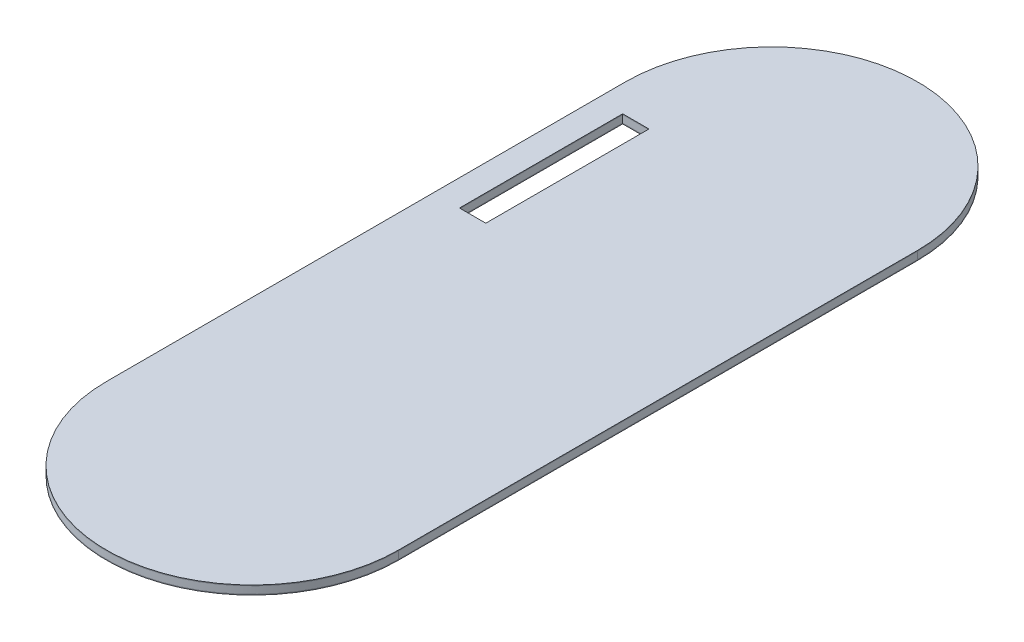
ISO-10303-21;
HEADER;
FILE_DESCRIPTION(('STEP AP214'),'2;1');
FILE_NAME('part.step','',(''),(''),'','','');
FILE_SCHEMA(('AUTOMOTIVE_DESIGN { 1 0 10303 214 1 1 1 1 }'));
ENDSEC;
DATA;
#1=APPLICATION_CONTEXT('core data for automotive mechanical design processes');
#2=APPLICATION_PROTOCOL_DEFINITION('international standard','automotive_design',2000,#1);
#3=PRODUCT_CONTEXT('',#1,'mechanical');
#4=PRODUCT('Part','Part','',(#3));
#5=PRODUCT_RELATED_PRODUCT_CATEGORY('part','',(#4));
#6=PRODUCT_DEFINITION_FORMATION('','',#4);
#7=PRODUCT_DEFINITION_CONTEXT('part definition',#1,'design');
#8=PRODUCT_DEFINITION('design','',#6,#7);
#9=PRODUCT_DEFINITION_SHAPE('','',#8);
#10=(LENGTH_UNIT() NAMED_UNIT(*) SI_UNIT(.MILLI.,.METRE.));
#11=(NAMED_UNIT(*) PLANE_ANGLE_UNIT() SI_UNIT($,.RADIAN.));
#12=(NAMED_UNIT(*) SI_UNIT($,.STERADIAN.) SOLID_ANGLE_UNIT());
#13=UNCERTAINTY_MEASURE_WITH_UNIT(LENGTH_MEASURE(1.E-05),#10,'distance_accuracy_value','');
#14=(GEOMETRIC_REPRESENTATION_CONTEXT(3) GLOBAL_UNCERTAINTY_ASSIGNED_CONTEXT((#13)) GLOBAL_UNIT_ASSIGNED_CONTEXT((#10,
#11,#12)) REPRESENTATION_CONTEXT('',''));
#15=CARTESIAN_POINT('',(0.,0.,0.));
#16=DIRECTION('',(0.,0.,1.));
#17=DIRECTION('',(1.,0.,0.));
#18=AXIS2_PLACEMENT_3D('',#15,#16,#17);
#19=CARTESIAN_POINT('',(0.,3.,-23.02));
#20=DIRECTION('',(0.,0.,1.));
#21=DIRECTION('',(1.,0.,0.));
#22=AXIS2_PLACEMENT_3D('',#19,#20,#21);
#23=PLANE('',#22);
#24=DIRECTION('',(-1.,0.,0.));
#25=VECTOR('',#24,1.);
#26=CARTESIAN_POINT('',(0.,2.75,-23.02));
#27=LINE('',#26,#25);
#28=CARTESIAN_POINT('',(-32.,2.75,-23.02));
#29=VERTEX_POINT('',#28);
#30=CARTESIAN_POINT('',(-41.,2.75,-23.02));
#31=VERTEX_POINT('',#30);
#32=EDGE_CURVE('E165',#29,#31,#27,.T.);
#33=ORIENTED_EDGE('',*,*,#32,.T.);
#34=DIRECTION('',(0.,-1.,0.));
#35=VECTOR('',#34,1.);
#36=CARTESIAN_POINT('',(-41.,3.,-23.02));
#37=LINE('',#36,#35);
#38=CARTESIAN_POINT('',(-41.,3.,-23.02));
#39=VERTEX_POINT('',#38);
#40=EDGE_CURVE('E12',#39,#31,#37,.T.);
#41=ORIENTED_EDGE('',*,*,#40,.F.);
#42=DIRECTION('',(-1.,0.,0.));
#43=VECTOR('',#42,1.);
#44=CARTESIAN_POINT('',(0.,3.,-23.02));
#45=LINE('',#44,#43);
#46=CARTESIAN_POINT('',(-32.,3.,-23.02));
#47=VERTEX_POINT('',#46);
#48=EDGE_CURVE('E142',#47,#39,#45,.T.);
#49=ORIENTED_EDGE('',*,*,#48,.F.);
#50=DIRECTION('',(0.,-1.,0.));
#51=VECTOR('',#50,1.);
#52=CARTESIAN_POINT('',(-32.,3.,-23.02));
#53=LINE('',#52,#51);
#54=EDGE_CURVE('E172',#47,#29,#53,.T.);
#55=ORIENTED_EDGE('',*,*,#54,.T.);
#56=EDGE_LOOP('',(#33,#41,#49,#55));
#57=FACE_BOUND('',#56,.T.);
#58=ADVANCED_FACE('F60',(#57),#23,.F.);
#59=CARTESIAN_POINT('',(-41.,3.,0.));
#60=DIRECTION('',(-1.,0.,0.));
#61=DIRECTION('',(0.,0.,1.));
#62=AXIS2_PLACEMENT_3D('',#59,#60,#61);
#63=PLANE('',#62);
#64=DIRECTION('',(0.,0.,-1.));
#65=VECTOR('',#64,1.);
#66=CARTESIAN_POINT('',(-41.,2.75,0.));
#67=LINE('',#66,#65);
#68=CARTESIAN_POINT('',(-41.,2.75,-78.9));
#69=VERTEX_POINT('',#68);
#70=EDGE_CURVE('E147',#31,#69,#67,.T.);
#71=ORIENTED_EDGE('',*,*,#70,.T.);
#72=DIRECTION('',(0.,-1.,0.));
#73=VECTOR('',#72,1.);
#74=CARTESIAN_POINT('',(-41.,3.,-78.9));
#75=LINE('',#74,#73);
#76=CARTESIAN_POINT('',(-41.,3.,-78.9));
#77=VERTEX_POINT('',#76);
#78=EDGE_CURVE('E70',#77,#69,#75,.T.);
#79=ORIENTED_EDGE('',*,*,#78,.F.);
#80=DIRECTION('',(0.,0.,-1.));
#81=VECTOR('',#80,1.);
#82=CARTESIAN_POINT('',(-41.,3.,0.));
#83=LINE('',#82,#81);
#84=EDGE_CURVE('E136',#39,#77,#83,.T.);
#85=ORIENTED_EDGE('',*,*,#84,.F.);
#86=ORIENTED_EDGE('',*,*,#40,.T.);
#87=EDGE_LOOP('',(#71,#79,#85,#86));
#88=FACE_BOUND('',#87,.T.);
#89=ADVANCED_FACE('F146',(#88),#63,.F.);
#90=CARTESIAN_POINT('',(0.,3.,-78.9));
#91=DIRECTION('',(0.,0.,-1.));
#92=DIRECTION('',(-1.,0.,0.));
#93=AXIS2_PLACEMENT_3D('',#90,#91,#92);
#94=PLANE('',#93);
#95=DIRECTION('',(1.,0.,0.));
#96=VECTOR('',#95,1.);
#97=CARTESIAN_POINT('',(0.,2.75,-78.9));
#98=LINE('',#97,#96);
#99=CARTESIAN_POINT('',(-32.0000000000001,2.75,-78.9));
#100=VERTEX_POINT('',#99);
#101=EDGE_CURVE('E108',#69,#100,#98,.T.);
#102=ORIENTED_EDGE('',*,*,#101,.T.);
#103=DIRECTION('',(0.,-1.,0.));
#104=VECTOR('',#103,1.);
#105=CARTESIAN_POINT('',(-32.0000000000001,3.,-78.9));
#106=LINE('',#105,#104);
#107=CARTESIAN_POINT('',(-32.0000000000001,3.,-78.9));
#108=VERTEX_POINT('',#107);
#109=EDGE_CURVE('E148',#108,#100,#106,.T.);
#110=ORIENTED_EDGE('',*,*,#109,.F.);
#111=DIRECTION('',(1.,0.,0.));
#112=VECTOR('',#111,1.);
#113=CARTESIAN_POINT('',(0.,3.,-78.9));
#114=LINE('',#113,#112);
#115=EDGE_CURVE('E140',#77,#108,#114,.T.);
#116=ORIENTED_EDGE('',*,*,#115,.F.);
#117=ORIENTED_EDGE('',*,*,#78,.T.);
#118=EDGE_LOOP('',(#102,#110,#116,#117));
#119=FACE_BOUND('',#118,.T.);
#120=ADVANCED_FACE('F150',(#119),#94,.F.);
#121=CARTESIAN_POINT('',(0.,3.,88.9));
#122=DIRECTION('',(0.,-1.,0.));
#123=DIRECTION('',(0.,0.,-1.));
#124=AXIS2_PLACEMENT_3D('',#121,#122,#123);
#125=CYLINDRICAL_SURFACE('',#124,50.);
#126=CARTESIAN_POINT('',(0.,2.75,88.9));
#127=DIRECTION('',(0.,1.,0.));
#128=DIRECTION('',(0.,0.,1.));
#129=AXIS2_PLACEMENT_3D('',#126,#127,#128);
#130=CIRCLE('',#129,50.);
#131=CARTESIAN_POINT('',(-50.,2.75,88.9));
#132=VERTEX_POINT('',#131);
#133=CARTESIAN_POINT('',(50.,2.75,88.9));
#134=VERTEX_POINT('',#133);
#135=EDGE_CURVE('E156',#132,#134,#130,.T.);
#136=ORIENTED_EDGE('',*,*,#135,.T.);
#137=DIRECTION('',(0.,-1.,0.));
#138=VECTOR('',#137,1.);
#139=CARTESIAN_POINT('',(50.,3.,88.9));
#140=LINE('',#139,#138);
#141=CARTESIAN_POINT('',(50.,3.,88.9));
#142=VERTEX_POINT('',#141);
#143=EDGE_CURVE('E64',#142,#134,#140,.T.);
#144=ORIENTED_EDGE('',*,*,#143,.F.);
#145=CARTESIAN_POINT('',(0.,3.,88.9));
#146=DIRECTION('',(0.,1.,0.));
#147=DIRECTION('',(0.,0.,1.));
#148=AXIS2_PLACEMENT_3D('',#145,#146,#147);
#149=CIRCLE('',#148,50.);
#150=CARTESIAN_POINT('',(-50.,3.,88.9));
#151=VERTEX_POINT('',#150);
#152=EDGE_CURVE('E171',#151,#142,#149,.T.);
#153=ORIENTED_EDGE('',*,*,#152,.F.);
#154=DIRECTION('',(0.,-1.,0.));
#155=VECTOR('',#154,1.);
#156=CARTESIAN_POINT('',(-50.,3.,88.9));
#157=LINE('',#156,#155);
#158=EDGE_CURVE('E152',#151,#132,#157,.T.);
#159=ORIENTED_EDGE('',*,*,#158,.T.);
#160=EDGE_LOOP('',(#136,#144,#153,#159));
#161=FACE_BOUND('',#160,.T.);
#162=ADVANCED_FACE('F62',(#161),#125,.T.);
#163=CARTESIAN_POINT('',(50.0000000000001,3.,0.));
#164=DIRECTION('',(-1.,0.,0.));
#165=DIRECTION('',(0.,0.,1.));
#166=AXIS2_PLACEMENT_3D('',#163,#164,#165);
#167=PLANE('',#166);
#168=DIRECTION('',(0.,0.,-1.));
#169=VECTOR('',#168,1.);
#170=CARTESIAN_POINT('',(50.0000000000001,2.75,0.));
#171=LINE('',#170,#169);
#172=CARTESIAN_POINT('',(50.,2.75,-88.9));
#173=VERTEX_POINT('',#172);
#174=EDGE_CURVE('E159',#134,#173,#171,.T.);
#175=ORIENTED_EDGE('',*,*,#174,.T.);
#176=DIRECTION('',(0.,-1.,0.));
#177=VECTOR('',#176,1.);
#178=CARTESIAN_POINT('',(50.,3.,-88.9));
#179=LINE('',#178,#177);
#180=CARTESIAN_POINT('',(50.,3.,-88.9));
#181=VERTEX_POINT('',#180);
#182=EDGE_CURVE('E179',#181,#173,#179,.T.);
#183=ORIENTED_EDGE('',*,*,#182,.F.);
#184=DIRECTION('',(0.,0.,-1.));
#185=VECTOR('',#184,1.);
#186=CARTESIAN_POINT('',(50.0000000000001,3.,0.));
#187=LINE('',#186,#185);
#188=EDGE_CURVE('E123',#142,#181,#187,.T.);
#189=ORIENTED_EDGE('',*,*,#188,.F.);
#190=ORIENTED_EDGE('',*,*,#143,.T.);
#191=EDGE_LOOP('',(#175,#183,#189,#190));
#192=FACE_BOUND('',#191,.T.);
#193=ADVANCED_FACE('F185',(#192),#167,.F.);
#194=CARTESIAN_POINT('',(0.,3.,-88.9));
#195=DIRECTION('',(0.,-1.,0.));
#196=DIRECTION('',(0.,0.,-1.));
#197=AXIS2_PLACEMENT_3D('',#194,#195,#196);
#198=CYLINDRICAL_SURFACE('',#197,50.);
#199=CARTESIAN_POINT('',(0.,2.75,-88.9));
#200=DIRECTION('',(0.,1.,0.));
#201=DIRECTION('',(0.,0.,1.));
#202=AXIS2_PLACEMENT_3D('',#199,#200,#201);
#203=CIRCLE('',#202,50.);
#204=CARTESIAN_POINT('',(-50.,2.75,-88.9));
#205=VERTEX_POINT('',#204);
#206=EDGE_CURVE('E161',#173,#205,#203,.T.);
#207=ORIENTED_EDGE('',*,*,#206,.T.);
#208=DIRECTION('',(0.,-1.,0.));
#209=VECTOR('',#208,1.);
#210=CARTESIAN_POINT('',(-50.,3.,-88.9));
#211=LINE('',#210,#209);
#212=CARTESIAN_POINT('',(-50.,3.,-88.9));
#213=VERTEX_POINT('',#212);
#214=EDGE_CURVE('E177',#213,#205,#211,.T.);
#215=ORIENTED_EDGE('',*,*,#214,.F.);
#216=CARTESIAN_POINT('',(0.,3.,-88.9));
#217=DIRECTION('',(0.,1.,0.));
#218=DIRECTION('',(0.,0.,1.));
#219=AXIS2_PLACEMENT_3D('',#216,#217,#218);
#220=CIRCLE('',#219,50.);
#221=EDGE_CURVE('E201',#181,#213,#220,.T.);
#222=ORIENTED_EDGE('',*,*,#221,.F.);
#223=ORIENTED_EDGE('',*,*,#182,.T.);
#224=EDGE_LOOP('',(#207,#215,#222,#223));
#225=FACE_BOUND('',#224,.T.);
#226=ADVANCED_FACE('F195',(#225),#198,.T.);
#227=CARTESIAN_POINT('',(-50.,3.,0.));
#228=DIRECTION('',(1.,0.,0.));
#229=DIRECTION('',(0.,0.,-1.));
#230=AXIS2_PLACEMENT_3D('',#227,#228,#229);
#231=PLANE('',#230);
#232=DIRECTION('',(0.,0.,1.));
#233=VECTOR('',#232,1.);
#234=CARTESIAN_POINT('',(-50.,2.75,0.));
#235=LINE('',#234,#233);
#236=EDGE_CURVE('E163',#205,#132,#235,.T.);
#237=ORIENTED_EDGE('',*,*,#236,.T.);
#238=ORIENTED_EDGE('',*,*,#158,.F.);
#239=DIRECTION('',(0.,0.,1.));
#240=VECTOR('',#239,1.);
#241=CARTESIAN_POINT('',(-50.,3.,0.));
#242=LINE('',#241,#240);
#243=EDGE_CURVE('E199',#213,#151,#242,.T.);
#244=ORIENTED_EDGE('',*,*,#243,.F.);
#245=ORIENTED_EDGE('',*,*,#214,.T.);
#246=EDGE_LOOP('',(#237,#238,#244,#245));
#247=FACE_BOUND('',#246,.T.);
#248=ADVANCED_FACE('F198',(#247),#231,.F.);
#249=CARTESIAN_POINT('',(-32.,3.,0.));
#250=DIRECTION('',(1.,0.,0.));
#251=DIRECTION('',(0.,0.,-1.));
#252=AXIS2_PLACEMENT_3D('',#249,#250,#251);
#253=PLANE('',#252);
#254=DIRECTION('',(0.,0.,1.));
#255=VECTOR('',#254,1.);
#256=CARTESIAN_POINT('',(-32.,2.75,0.));
#257=LINE('',#256,#255);
#258=EDGE_CURVE('E114',#100,#29,#257,.T.);
#259=ORIENTED_EDGE('',*,*,#258,.T.);
#260=ORIENTED_EDGE('',*,*,#54,.F.);
#261=DIRECTION('',(0.,0.,1.));
#262=VECTOR('',#261,1.);
#263=CARTESIAN_POINT('',(-32.,3.,0.));
#264=LINE('',#263,#262);
#265=EDGE_CURVE('E79',#108,#47,#264,.T.);
#266=ORIENTED_EDGE('',*,*,#265,.F.);
#267=ORIENTED_EDGE('',*,*,#109,.T.);
#268=EDGE_LOOP('',(#259,#260,#266,#267));
#269=FACE_BOUND('',#268,.T.);
#270=ADVANCED_FACE('F207',(#269),#253,.F.);
#271=CARTESIAN_POINT('',(0.,3.,0.));
#272=DIRECTION('',(0.,1.,0.));
#273=DIRECTION('',(0.,0.,1.));
#274=AXIS2_PLACEMENT_3D('',#271,#272,#273);
#275=PLANE('',#274);
#276=ORIENTED_EDGE('',*,*,#152,.T.);
#277=ORIENTED_EDGE('',*,*,#188,.T.);
#278=ORIENTED_EDGE('',*,*,#221,.T.);
#279=ORIENTED_EDGE('',*,*,#243,.T.);
#280=EDGE_LOOP('',(#276,#277,#278,#279));
#281=FACE_BOUND('',#280,.T.);
#282=ORIENTED_EDGE('',*,*,#48,.T.);
#283=ORIENTED_EDGE('',*,*,#84,.T.);
#284=ORIENTED_EDGE('',*,*,#115,.T.);
#285=ORIENTED_EDGE('',*,*,#265,.T.);
#286=EDGE_LOOP('',(#282,#283,#284,#285));
#287=FACE_BOUND('',#286,.T.);
#288=ADVANCED_FACE('F138',(#281,#287),#275,.T.);
#289=CARTESIAN_POINT('',(0.,2.75,0.));
#290=DIRECTION('',(0.,1.,0.));
#291=DIRECTION('',(0.,0.,1.));
#292=AXIS2_PLACEMENT_3D('',#289,#290,#291);
#293=PLANE('',#292);
#294=ORIENTED_EDGE('',*,*,#135,.F.);
#295=ORIENTED_EDGE('',*,*,#236,.F.);
#296=ORIENTED_EDGE('',*,*,#206,.F.);
#297=ORIENTED_EDGE('',*,*,#174,.F.);
#298=EDGE_LOOP('',(#294,#295,#296,#297));
#299=FACE_BOUND('',#298,.T.);
#300=ORIENTED_EDGE('',*,*,#32,.F.);
#301=ORIENTED_EDGE('',*,*,#258,.F.);
#302=ORIENTED_EDGE('',*,*,#101,.F.);
#303=ORIENTED_EDGE('',*,*,#70,.F.);
#304=EDGE_LOOP('',(#300,#301,#302,#303));
#305=FACE_BOUND('',#304,.T.);
#306=ADVANCED_FACE('F192',(#299,#305),#293,.F.);
#307=CLOSED_SHELL('',(#58,#89,#120,#162,#193,#226,#248,#270,#288,#306));
#308=MANIFOLD_SOLID_BREP('B2',#307);
#309=CARTESIAN_POINT('',(50.0000000000001,2.75,0.));
#310=DIRECTION('',(-1.,0.,0.));
#311=DIRECTION('',(0.,0.,1.));
#312=AXIS2_PLACEMENT_3D('',#309,#310,#311);
#313=PLANE('',#312);
#314=DIRECTION('',(0.,0.,-1.));
#315=VECTOR('',#314,1.);
#316=CARTESIAN_POINT('',(50.0000000000001,0.25,0.));
#317=LINE('',#316,#315);
#318=CARTESIAN_POINT('',(50.0000000000001,0.25,88.8999999999999));
#319=VERTEX_POINT('',#318);
#320=CARTESIAN_POINT('',(50.,0.25,-88.9));
#321=VERTEX_POINT('',#320);
#322=EDGE_CURVE('E425',#319,#321,#317,.T.);
#323=ORIENTED_EDGE('',*,*,#322,.T.);
#324=DIRECTION('',(0.,-1.,0.));
#325=VECTOR('',#324,1.);
#326=CARTESIAN_POINT('',(50.,2.75,-88.9));
#327=LINE('',#326,#325);
#328=CARTESIAN_POINT('',(50.,2.75,-88.9));
#329=VERTEX_POINT('',#328);
#330=EDGE_CURVE('E58',#329,#321,#327,.T.);
#331=ORIENTED_EDGE('',*,*,#330,.F.);
#332=DIRECTION('',(0.,0.,-1.));
#333=VECTOR('',#332,1.);
#334=CARTESIAN_POINT('',(50.0000000000001,2.75,0.));
#335=LINE('',#334,#333);
#336=CARTESIAN_POINT('',(50.0000000000001,2.75,88.8999999999999));
#337=VERTEX_POINT('',#336);
#338=EDGE_CURVE('E394',#337,#329,#335,.T.);
#339=ORIENTED_EDGE('',*,*,#338,.F.);
#340=DIRECTION('',(0.,-1.,0.));
#341=VECTOR('',#340,1.);
#342=CARTESIAN_POINT('',(50.0000000000001,2.75,88.8999999999999));
#343=LINE('',#342,#341);
#344=EDGE_CURVE('E436',#337,#319,#343,.T.);
#345=ORIENTED_EDGE('',*,*,#344,.T.);
#346=EDGE_LOOP('',(#323,#331,#339,#345));
#347=FACE_BOUND('',#346,.T.);
#348=ADVANCED_FACE('F311',(#347),#313,.F.);
#349=CARTESIAN_POINT('',(0.,2.75,-88.9));
#350=DIRECTION('',(0.,-1.,0.));
#351=DIRECTION('',(0.,0.,-1.));
#352=AXIS2_PLACEMENT_3D('',#349,#350,#351);
#353=CYLINDRICAL_SURFACE('',#352,50.);
#354=CARTESIAN_POINT('',(0.,0.25,-88.9));
#355=DIRECTION('',(0.,1.,0.));
#356=DIRECTION('',(0.,0.,1.));
#357=AXIS2_PLACEMENT_3D('',#354,#355,#356);
#358=CIRCLE('',#357,50.);
#359=CARTESIAN_POINT('',(-50.,0.25,-88.9));
#360=VERTEX_POINT('',#359);
#361=EDGE_CURVE('E400',#321,#360,#358,.T.);
#362=ORIENTED_EDGE('',*,*,#361,.T.);
#363=DIRECTION('',(0.,-1.,0.));
#364=VECTOR('',#363,1.);
#365=CARTESIAN_POINT('',(-50.,2.75,-88.9));
#366=LINE('',#365,#364);
#367=CARTESIAN_POINT('',(-50.,2.75,-88.9));
#368=VERTEX_POINT('',#367);
#369=EDGE_CURVE('E322',#368,#360,#366,.T.);
#370=ORIENTED_EDGE('',*,*,#369,.F.);
#371=CARTESIAN_POINT('',(0.,2.75,-88.9));
#372=DIRECTION('',(0.,1.,0.));
#373=DIRECTION('',(0.,0.,1.));
#374=AXIS2_PLACEMENT_3D('',#371,#372,#373);
#375=CIRCLE('',#374,50.);
#376=EDGE_CURVE('E388',#329,#368,#375,.T.);
#377=ORIENTED_EDGE('',*,*,#376,.F.);
#378=ORIENTED_EDGE('',*,*,#330,.T.);
#379=EDGE_LOOP('',(#362,#370,#377,#378));
#380=FACE_BOUND('',#379,.T.);
#381=ADVANCED_FACE('F399',(#380),#353,.T.);
#382=CARTESIAN_POINT('',(-50.,2.75,0.));
#383=DIRECTION('',(1.,0.,0.));
#384=DIRECTION('',(0.,0.,-1.));
#385=AXIS2_PLACEMENT_3D('',#382,#383,#384);
#386=PLANE('',#385);
#387=DIRECTION('',(0.,0.,1.));
#388=VECTOR('',#387,1.);
#389=CARTESIAN_POINT('',(-50.,0.25,0.));
#390=LINE('',#389,#388);
#391=CARTESIAN_POINT('',(-50.,0.25,88.9));
#392=VERTEX_POINT('',#391);
#393=EDGE_CURVE('E360',#360,#392,#390,.T.);
#394=ORIENTED_EDGE('',*,*,#393,.T.);
#395=DIRECTION('',(0.,-1.,0.));
#396=VECTOR('',#395,1.);
#397=CARTESIAN_POINT('',(-50.,2.75,88.9));
#398=LINE('',#397,#396);
#399=CARTESIAN_POINT('',(-50.,2.75,88.9));
#400=VERTEX_POINT('',#399);
#401=EDGE_CURVE('E402',#400,#392,#398,.T.);
#402=ORIENTED_EDGE('',*,*,#401,.F.);
#403=DIRECTION('',(0.,0.,1.));
#404=VECTOR('',#403,1.);
#405=CARTESIAN_POINT('',(-50.,2.75,0.));
#406=LINE('',#405,#404);
#407=EDGE_CURVE('E392',#368,#400,#406,.T.);
#408=ORIENTED_EDGE('',*,*,#407,.F.);
#409=ORIENTED_EDGE('',*,*,#369,.T.);
#410=EDGE_LOOP('',(#394,#402,#408,#409));
#411=FACE_BOUND('',#410,.T.);
#412=ADVANCED_FACE('F404',(#411),#386,.F.);
#413=CARTESIAN_POINT('',(-41.,2.75,0.));
#414=DIRECTION('',(-1.,0.,0.));
#415=DIRECTION('',(0.,0.,1.));
#416=AXIS2_PLACEMENT_3D('',#413,#414,#415);
#417=PLANE('',#416);
#418=DIRECTION('',(0.,0.,-1.));
#419=VECTOR('',#418,1.);
#420=CARTESIAN_POINT('',(-41.,0.25,0.));
#421=LINE('',#420,#419);
#422=CARTESIAN_POINT('',(-41.,0.25,-23.02));
#423=VERTEX_POINT('',#422);
#424=CARTESIAN_POINT('',(-41.,0.25,-78.9));
#425=VERTEX_POINT('',#424);
#426=EDGE_CURVE('E412',#423,#425,#421,.T.);
#427=ORIENTED_EDGE('',*,*,#426,.T.);
#428=DIRECTION('',(0.,-1.,0.));
#429=VECTOR('',#428,1.);
#430=CARTESIAN_POINT('',(-41.,2.75,-78.9));
#431=LINE('',#430,#429);
#432=CARTESIAN_POINT('',(-41.,2.75,-78.9));
#433=VERTEX_POINT('',#432);
#434=EDGE_CURVE('E315',#433,#425,#431,.T.);
#435=ORIENTED_EDGE('',*,*,#434,.F.);
#436=DIRECTION('',(0.,0.,-1.));
#437=VECTOR('',#436,1.);
#438=CARTESIAN_POINT('',(-41.,2.75,0.));
#439=LINE('',#438,#437);
#440=CARTESIAN_POINT('',(-41.,2.75,-23.02));
#441=VERTEX_POINT('',#440);
#442=EDGE_CURVE('E435',#441,#433,#439,.T.);
#443=ORIENTED_EDGE('',*,*,#442,.F.);
#444=DIRECTION('',(0.,-1.,0.));
#445=VECTOR('',#444,1.);
#446=CARTESIAN_POINT('',(-41.,2.75,-23.02));
#447=LINE('',#446,#445);
#448=EDGE_CURVE('E408',#441,#423,#447,.T.);
#449=ORIENTED_EDGE('',*,*,#448,.T.);
#450=EDGE_LOOP('',(#427,#435,#443,#449));
#451=FACE_BOUND('',#450,.T.);
#452=ADVANCED_FACE('F313',(#451),#417,.F.);
#453=CARTESIAN_POINT('',(0.,2.75,-78.9));
#454=DIRECTION('',(0.,0.,-1.));
#455=DIRECTION('',(-1.,0.,0.));
#456=AXIS2_PLACEMENT_3D('',#453,#454,#455);
#457=PLANE('',#456);
#458=DIRECTION('',(1.,0.,0.));
#459=VECTOR('',#458,1.);
#460=CARTESIAN_POINT('',(0.,0.25,-78.9));
#461=LINE('',#460,#459);
#462=CARTESIAN_POINT('',(-32.0000000000001,0.25,-78.9));
#463=VERTEX_POINT('',#462);
#464=EDGE_CURVE('E416',#425,#463,#461,.T.);
#465=ORIENTED_EDGE('',*,*,#464,.T.);
#466=DIRECTION('',(0.,-1.,0.));
#467=VECTOR('',#466,1.);
#468=CARTESIAN_POINT('',(-32.0000000000001,2.75,-78.9));
#469=LINE('',#468,#467);
#470=CARTESIAN_POINT('',(-32.0000000000001,2.75,-78.9));
#471=VERTEX_POINT('',#470);
#472=EDGE_CURVE('E447',#471,#463,#469,.T.);
#473=ORIENTED_EDGE('',*,*,#472,.F.);
#474=DIRECTION('',(1.,0.,0.));
#475=VECTOR('',#474,1.);
#476=CARTESIAN_POINT('',(0.,2.75,-78.9));
#477=LINE('',#476,#475);
#478=EDGE_CURVE('E375',#433,#471,#477,.T.);
#479=ORIENTED_EDGE('',*,*,#478,.F.);
#480=ORIENTED_EDGE('',*,*,#434,.T.);
#481=EDGE_LOOP('',(#465,#473,#479,#480));
#482=FACE_BOUND('',#481,.T.);
#483=ADVANCED_FACE('F455',(#482),#457,.F.);
#484=CARTESIAN_POINT('',(-32.,2.75,0.));
#485=DIRECTION('',(1.,0.,0.));
#486=DIRECTION('',(0.,0.,-1.));
#487=AXIS2_PLACEMENT_3D('',#484,#485,#486);
#488=PLANE('',#487);
#489=DIRECTION('',(0.,0.,1.));
#490=VECTOR('',#489,1.);
#491=CARTESIAN_POINT('',(-32.,0.25,0.));
#492=LINE('',#491,#490);
#493=CARTESIAN_POINT('',(-32.,0.25,-23.02));
#494=VERTEX_POINT('',#493);
#495=EDGE_CURVE('E419',#463,#494,#492,.T.);
#496=ORIENTED_EDGE('',*,*,#495,.T.);
#497=DIRECTION('',(0.,-1.,0.));
#498=VECTOR('',#497,1.);
#499=CARTESIAN_POINT('',(-32.,2.75,-23.02));
#500=LINE('',#499,#498);
#501=CARTESIAN_POINT('',(-32.,2.75,-23.02));
#502=VERTEX_POINT('',#501);
#503=EDGE_CURVE('E444',#502,#494,#500,.T.);
#504=ORIENTED_EDGE('',*,*,#503,.F.);
#505=DIRECTION('',(0.,0.,1.));
#506=VECTOR('',#505,1.);
#507=CARTESIAN_POINT('',(-32.,2.75,0.));
#508=LINE('',#507,#506);
#509=EDGE_CURVE('E472',#471,#502,#508,.T.);
#510=ORIENTED_EDGE('',*,*,#509,.F.);
#511=ORIENTED_EDGE('',*,*,#472,.T.);
#512=EDGE_LOOP('',(#496,#504,#510,#511));
#513=FACE_BOUND('',#512,.T.);
#514=ADVANCED_FACE('F465',(#513),#488,.F.);
#515=CARTESIAN_POINT('',(0.,2.75,-23.02));
#516=DIRECTION('',(0.,0.,1.));
#517=DIRECTION('',(1.,0.,0.));
#518=AXIS2_PLACEMENT_3D('',#515,#516,#517);
#519=PLANE('',#518);
#520=DIRECTION('',(-1.,0.,0.));
#521=VECTOR('',#520,1.);
#522=CARTESIAN_POINT('',(0.,0.25,-23.02));
#523=LINE('',#522,#521);
#524=EDGE_CURVE('E422',#494,#423,#523,.T.);
#525=ORIENTED_EDGE('',*,*,#524,.T.);
#526=ORIENTED_EDGE('',*,*,#448,.F.);
#527=DIRECTION('',(-1.,0.,0.));
#528=VECTOR('',#527,1.);
#529=CARTESIAN_POINT('',(0.,2.75,-23.02));
#530=LINE('',#529,#528);
#531=EDGE_CURVE('E469',#502,#441,#530,.T.);
#532=ORIENTED_EDGE('',*,*,#531,.F.);
#533=ORIENTED_EDGE('',*,*,#503,.T.);
#534=EDGE_LOOP('',(#525,#526,#532,#533));
#535=FACE_BOUND('',#534,.T.);
#536=ADVANCED_FACE('F468',(#535),#519,.F.);
#537=CARTESIAN_POINT('',(0.,2.75,88.9));
#538=DIRECTION('',(0.,-1.,0.));
#539=DIRECTION('',(0.,0.,-1.));
#540=AXIS2_PLACEMENT_3D('',#537,#538,#539);
#541=CYLINDRICAL_SURFACE('',#540,50.);
#542=CARTESIAN_POINT('',(0.,0.25,88.9));
#543=DIRECTION('',(0.,1.,0.));
#544=DIRECTION('',(0.,0.,1.));
#545=AXIS2_PLACEMENT_3D('',#542,#543,#544);
#546=CIRCLE('',#545,50.);
#547=EDGE_CURVE('E366',#392,#319,#546,.T.);
#548=ORIENTED_EDGE('',*,*,#547,.T.);
#549=ORIENTED_EDGE('',*,*,#344,.F.);
#550=CARTESIAN_POINT('',(0.,2.75,88.9));
#551=DIRECTION('',(0.,1.,0.));
#552=DIRECTION('',(0.,0.,1.));
#553=AXIS2_PLACEMENT_3D('',#550,#551,#552);
#554=CIRCLE('',#553,50.);
#555=EDGE_CURVE('E331',#400,#337,#554,.T.);
#556=ORIENTED_EDGE('',*,*,#555,.F.);
#557=ORIENTED_EDGE('',*,*,#401,.T.);
#558=EDGE_LOOP('',(#548,#549,#556,#557));
#559=FACE_BOUND('',#558,.T.);
#560=ADVANCED_FACE('F482',(#559),#541,.T.);
#561=CARTESIAN_POINT('',(0.,2.75,0.));
#562=DIRECTION('',(0.,1.,0.));
#563=DIRECTION('',(0.,0.,1.));
#564=AXIS2_PLACEMENT_3D('',#561,#562,#563);
#565=PLANE('',#564);
#566=ORIENTED_EDGE('',*,*,#442,.T.);
#567=ORIENTED_EDGE('',*,*,#478,.T.);
#568=ORIENTED_EDGE('',*,*,#509,.T.);
#569=ORIENTED_EDGE('',*,*,#531,.T.);
#570=EDGE_LOOP('',(#566,#567,#568,#569));
#571=FACE_BOUND('',#570,.T.);
#572=ORIENTED_EDGE('',*,*,#338,.T.);
#573=ORIENTED_EDGE('',*,*,#376,.T.);
#574=ORIENTED_EDGE('',*,*,#407,.T.);
#575=ORIENTED_EDGE('',*,*,#555,.T.);
#576=EDGE_LOOP('',(#572,#573,#574,#575));
#577=FACE_BOUND('',#576,.T.);
#578=ADVANCED_FACE('F390',(#571,#577),#565,.T.);
#579=CARTESIAN_POINT('',(0.,0.25,0.));
#580=DIRECTION('',(0.,1.,0.));
#581=DIRECTION('',(0.,0.,1.));
#582=AXIS2_PLACEMENT_3D('',#579,#580,#581);
#583=PLANE('',#582);
#584=ORIENTED_EDGE('',*,*,#426,.F.);
#585=ORIENTED_EDGE('',*,*,#524,.F.);
#586=ORIENTED_EDGE('',*,*,#495,.F.);
#587=ORIENTED_EDGE('',*,*,#464,.F.);
#588=EDGE_LOOP('',(#584,#585,#586,#587));
#589=FACE_BOUND('',#588,.T.);
#590=ORIENTED_EDGE('',*,*,#322,.F.);
#591=ORIENTED_EDGE('',*,*,#547,.F.);
#592=ORIENTED_EDGE('',*,*,#393,.F.);
#593=ORIENTED_EDGE('',*,*,#361,.F.);
#594=EDGE_LOOP('',(#590,#591,#592,#593));
#595=FACE_BOUND('',#594,.T.);
#596=ADVANCED_FACE('F462',(#589,#595),#583,.F.);
#597=CLOSED_SHELL('',(#348,#381,#412,#452,#483,#514,#536,#560,#578,#596));
#598=MANIFOLD_SOLID_BREP('B6',#597);
#599=CARTESIAN_POINT('',(0.,0.25,-88.9));
#600=DIRECTION('',(0.,1.,0.));
#601=DIRECTION('',(0.,0.,1.));
#602=AXIS2_PLACEMENT_3D('',#599,#600,#601);
#603=PLANE('',#602);
#604=CARTESIAN_POINT('',(0.,0.25,-88.9));
#605=DIRECTION('',(0.,1.,0.));
#606=DIRECTION('',(0.,0.,1.));
#607=AXIS2_PLACEMENT_3D('',#604,#605,#606);
#608=CIRCLE('',#607,50.);
#609=CARTESIAN_POINT('',(50.,0.25,-88.9));
#610=VERTEX_POINT('',#609);
#611=CARTESIAN_POINT('',(-50.,0.25,-88.9));
#612=VERTEX_POINT('',#611);
#613=EDGE_CURVE('E690',#610,#612,#608,.T.);
#614=ORIENTED_EDGE('',*,*,#613,.T.);
#615=DIRECTION('',(0.,0.,1.));
#616=VECTOR('',#615,1.);
#617=CARTESIAN_POINT('',(-50.,0.25,-88.9));
#618=LINE('',#617,#616);
#619=CARTESIAN_POINT('',(-50.,0.25,88.9));
#620=VERTEX_POINT('',#619);
#621=EDGE_CURVE('E693',#612,#620,#618,.T.);
#622=ORIENTED_EDGE('',*,*,#621,.T.);
#623=CARTESIAN_POINT('',(0.,0.25,88.9));
#624=DIRECTION('',(0.,1.,0.));
#625=DIRECTION('',(0.,0.,1.));
#626=AXIS2_PLACEMENT_3D('',#623,#624,#625);
#627=CIRCLE('',#626,50.);
#628=CARTESIAN_POINT('',(50.0000000000001,0.25,88.8999999999999));
#629=VERTEX_POINT('',#628);
#630=EDGE_CURVE('E696',#620,#629,#627,.T.);
#631=ORIENTED_EDGE('',*,*,#630,.T.);
#632=DIRECTION('',(0.,0.,-1.));
#633=VECTOR('',#632,1.);
#634=CARTESIAN_POINT('',(50.,0.25,-88.9));
#635=LINE('',#634,#633);
#636=EDGE_CURVE('E698',#629,#610,#635,.T.);
#637=ORIENTED_EDGE('',*,*,#636,.T.);
#638=EDGE_LOOP('',(#614,#622,#631,#637));
#639=FACE_BOUND('',#638,.T.);
#640=DIRECTION('',(-1.,0.,0.));
#641=VECTOR('',#640,1.);
#642=CARTESIAN_POINT('',(-41.,0.25,-78.9));
#643=LINE('',#642,#641);
#644=CARTESIAN_POINT('',(-32.0000000000001,0.25,-78.9));
#645=VERTEX_POINT('',#644);
#646=CARTESIAN_POINT('',(-41.,0.25,-78.9));
#647=VERTEX_POINT('',#646);
#648=EDGE_CURVE('E662',#645,#647,#643,.T.);
#649=ORIENTED_EDGE('',*,*,#648,.F.);
#650=DIRECTION('',(0.,0.,-1.));
#651=VECTOR('',#650,1.);
#652=CARTESIAN_POINT('',(-32.0000000000001,0.25,-78.9));
#653=LINE('',#652,#651);
#654=CARTESIAN_POINT('',(-32.,0.25,-23.02));
#655=VERTEX_POINT('',#654);
#656=EDGE_CURVE('E654',#655,#645,#653,.T.);
#657=ORIENTED_EDGE('',*,*,#656,.F.);
#658=DIRECTION('',(1.,0.,0.));
#659=VECTOR('',#658,1.);
#660=CARTESIAN_POINT('',(-32.,0.25,-23.02));
#661=LINE('',#660,#659);
#662=CARTESIAN_POINT('',(-41.,0.25,-23.02));
#663=VERTEX_POINT('',#662);
#664=EDGE_CURVE('E676',#663,#655,#661,.T.);
#665=ORIENTED_EDGE('',*,*,#664,.F.);
#666=DIRECTION('',(0.,0.,1.));
#667=VECTOR('',#666,1.);
#668=CARTESIAN_POINT('',(-41.,0.25,-23.02));
#669=LINE('',#668,#667);
#670=EDGE_CURVE('E674',#647,#663,#669,.T.);
#671=ORIENTED_EDGE('',*,*,#670,.F.);
#672=EDGE_LOOP('',(#649,#657,#665,#671));
#673=FACE_BOUND('',#672,.T.);
#674=ADVANCED_FACE('F589',(#639,#673),#603,.T.);
#675=CARTESIAN_POINT('',(0.,0.,-88.9));
#676=DIRECTION('',(0.,1.,0.));
#677=DIRECTION('',(0.,0.,1.));
#678=AXIS2_PLACEMENT_3D('',#675,#676,#677);
#679=PLANE('',#678);
#680=CARTESIAN_POINT('',(0.,0.,-88.9));
#681=DIRECTION('',(0.,1.,0.));
#682=DIRECTION('',(0.,0.,1.));
#683=AXIS2_PLACEMENT_3D('',#680,#681,#682);
#684=CIRCLE('',#683,50.);
#685=CARTESIAN_POINT('',(50.,0.,-88.9));
#686=VERTEX_POINT('',#685);
#687=CARTESIAN_POINT('',(-50.,0.,-88.9));
#688=VERTEX_POINT('',#687);
#689=EDGE_CURVE('E670',#686,#688,#684,.T.);
#690=ORIENTED_EDGE('',*,*,#689,.F.);
#691=DIRECTION('',(0.,0.,-1.));
#692=VECTOR('',#691,1.);
#693=CARTESIAN_POINT('',(50.,0.,-88.9));
#694=LINE('',#693,#692);
#695=CARTESIAN_POINT('',(50.0000000000001,0.,88.8999999999999));
#696=VERTEX_POINT('',#695);
#697=EDGE_CURVE('E694',#696,#686,#694,.T.);
#698=ORIENTED_EDGE('',*,*,#697,.F.);
#699=CARTESIAN_POINT('',(0.,0.,88.9));
#700=DIRECTION('',(0.,1.,0.));
#701=DIRECTION('',(0.,0.,1.));
#702=AXIS2_PLACEMENT_3D('',#699,#700,#701);
#703=CIRCLE('',#702,50.);
#704=CARTESIAN_POINT('',(-50.,0.,88.9));
#705=VERTEX_POINT('',#704);
#706=EDGE_CURVE('E705',#705,#696,#703,.T.);
#707=ORIENTED_EDGE('',*,*,#706,.F.);
#708=DIRECTION('',(0.,0.,1.));
#709=VECTOR('',#708,1.);
#710=CARTESIAN_POINT('',(-50.,0.,-88.9));
#711=LINE('',#710,#709);
#712=EDGE_CURVE('E703',#688,#705,#711,.T.);
#713=ORIENTED_EDGE('',*,*,#712,.F.);
#714=EDGE_LOOP('',(#690,#698,#707,#713));
#715=FACE_BOUND('',#714,.T.);
#716=DIRECTION('',(0.,0.,-1.));
#717=VECTOR('',#716,1.);
#718=CARTESIAN_POINT('',(-32.0000000000001,0.,-78.9));
#719=LINE('',#718,#717);
#720=CARTESIAN_POINT('',(-32.,0.,-23.02));
#721=VERTEX_POINT('',#720);
#722=CARTESIAN_POINT('',(-32.0000000000001,0.,-78.9));
#723=VERTEX_POINT('',#722);
#724=EDGE_CURVE('E612',#721,#723,#719,.T.);
#725=ORIENTED_EDGE('',*,*,#724,.T.);
#726=DIRECTION('',(-1.,0.,0.));
#727=VECTOR('',#726,1.);
#728=CARTESIAN_POINT('',(-41.,0.,-78.9));
#729=LINE('',#728,#727);
#730=CARTESIAN_POINT('',(-41.,0.,-78.9));
#731=VERTEX_POINT('',#730);
#732=EDGE_CURVE('E669',#723,#731,#729,.T.);
#733=ORIENTED_EDGE('',*,*,#732,.T.);
#734=DIRECTION('',(0.,0.,1.));
#735=VECTOR('',#734,1.);
#736=CARTESIAN_POINT('',(-41.,0.,-23.02));
#737=LINE('',#736,#735);
#738=CARTESIAN_POINT('',(-41.,0.,-23.02));
#739=VERTEX_POINT('',#738);
#740=EDGE_CURVE('E682',#731,#739,#737,.T.);
#741=ORIENTED_EDGE('',*,*,#740,.T.);
#742=DIRECTION('',(1.,0.,0.));
#743=VECTOR('',#742,1.);
#744=CARTESIAN_POINT('',(-32.,0.,-23.02));
#745=LINE('',#744,#743);
#746=EDGE_CURVE('E663',#739,#721,#745,.T.);
#747=ORIENTED_EDGE('',*,*,#746,.T.);
#748=EDGE_LOOP('',(#725,#733,#741,#747));
#749=FACE_BOUND('',#748,.T.);
#750=ADVANCED_FACE('F723',(#715,#749),#679,.F.);
#751=CARTESIAN_POINT('',(0.,0.25,-88.9));
#752=DIRECTION('',(0.,-1.,0.));
#753=DIRECTION('',(0.,0.,-1.));
#754=AXIS2_PLACEMENT_3D('',#751,#752,#753);
#755=CYLINDRICAL_SURFACE('',#754,50.);
#756=ORIENTED_EDGE('',*,*,#689,.T.);
#757=DIRECTION('',(0.,-1.,0.));
#758=VECTOR('',#757,1.);
#759=CARTESIAN_POINT('',(-50.,0.25,-88.9));
#760=LINE('',#759,#758);
#761=EDGE_CURVE('E309',#612,#688,#760,.T.);
#762=ORIENTED_EDGE('',*,*,#761,.F.);
#763=ORIENTED_EDGE('',*,*,#613,.F.);
#764=DIRECTION('',(0.,-1.,0.));
#765=VECTOR('',#764,1.);
#766=CARTESIAN_POINT('',(50.,0.25,-88.9));
#767=LINE('',#766,#765);
#768=EDGE_CURVE('E700',#610,#686,#767,.T.);
#769=ORIENTED_EDGE('',*,*,#768,.T.);
#770=EDGE_LOOP('',(#756,#762,#763,#769));
#771=FACE_BOUND('',#770,.T.);
#772=ADVANCED_FACE('F591',(#771),#755,.T.);
#773=CARTESIAN_POINT('',(-50.,0.25,-88.9));
#774=DIRECTION('',(1.,0.,0.));
#775=DIRECTION('',(0.,0.,-1.));
#776=AXIS2_PLACEMENT_3D('',#773,#774,#775);
#777=PLANE('',#776);
#778=ORIENTED_EDGE('',*,*,#712,.T.);
#779=DIRECTION('',(0.,-1.,0.));
#780=VECTOR('',#779,1.);
#781=CARTESIAN_POINT('',(-50.,0.25,88.9));
#782=LINE('',#781,#780);
#783=EDGE_CURVE('E597',#620,#705,#782,.T.);
#784=ORIENTED_EDGE('',*,*,#783,.F.);
#785=ORIENTED_EDGE('',*,*,#621,.F.);
#786=ORIENTED_EDGE('',*,*,#761,.T.);
#787=EDGE_LOOP('',(#778,#784,#785,#786));
#788=FACE_BOUND('',#787,.T.);
#789=ADVANCED_FACE('F733',(#788),#777,.F.);
#790=CARTESIAN_POINT('',(0.,0.25,88.9));
#791=DIRECTION('',(0.,-1.,0.));
#792=DIRECTION('',(0.,0.,-1.));
#793=AXIS2_PLACEMENT_3D('',#790,#791,#792);
#794=CYLINDRICAL_SURFACE('',#793,50.);
#795=ORIENTED_EDGE('',*,*,#706,.T.);
#796=DIRECTION('',(0.,-1.,0.));
#797=VECTOR('',#796,1.);
#798=CARTESIAN_POINT('',(50.0000000000001,0.25,88.8999999999999));
#799=LINE('',#798,#797);
#800=EDGE_CURVE('E710',#629,#696,#799,.T.);
#801=ORIENTED_EDGE('',*,*,#800,.F.);
#802=ORIENTED_EDGE('',*,*,#630,.F.);
#803=ORIENTED_EDGE('',*,*,#783,.T.);
#804=EDGE_LOOP('',(#795,#801,#802,#803));
#805=FACE_BOUND('',#804,.T.);
#806=ADVANCED_FACE('F717',(#805),#794,.T.);
#807=CARTESIAN_POINT('',(50.,0.25,-88.9));
#808=DIRECTION('',(-1.,0.,0.));
#809=DIRECTION('',(0.,0.,1.));
#810=AXIS2_PLACEMENT_3D('',#807,#808,#809);
#811=PLANE('',#810);
#812=ORIENTED_EDGE('',*,*,#697,.T.);
#813=ORIENTED_EDGE('',*,*,#768,.F.);
#814=ORIENTED_EDGE('',*,*,#636,.F.);
#815=ORIENTED_EDGE('',*,*,#800,.T.);
#816=EDGE_LOOP('',(#812,#813,#814,#815));
#817=FACE_BOUND('',#816,.T.);
#818=ADVANCED_FACE('F727',(#817),#811,.F.);
#819=CARTESIAN_POINT('',(-32.0000000000001,0.25,-78.9));
#820=DIRECTION('',(-1.,0.,0.));
#821=DIRECTION('',(0.,0.,1.));
#822=AXIS2_PLACEMENT_3D('',#819,#820,#821);
#823=PLANE('',#822);
#824=ORIENTED_EDGE('',*,*,#724,.F.);
#825=DIRECTION('',(0.,-1.,0.));
#826=VECTOR('',#825,1.);
#827=CARTESIAN_POINT('',(-32.,0.25,-23.02));
#828=LINE('',#827,#826);
#829=EDGE_CURVE('E658',#655,#721,#828,.T.);
#830=ORIENTED_EDGE('',*,*,#829,.F.);
#831=ORIENTED_EDGE('',*,*,#656,.T.);
#832=DIRECTION('',(0.,-1.,0.));
#833=VECTOR('',#832,1.);
#834=CARTESIAN_POINT('',(-32.0000000000001,0.25,-78.9));
#835=LINE('',#834,#833);
#836=EDGE_CURVE('E657',#645,#723,#835,.T.);
#837=ORIENTED_EDGE('',*,*,#836,.T.);
#838=EDGE_LOOP('',(#824,#830,#831,#837));
#839=FACE_BOUND('',#838,.T.);
#840=ADVANCED_FACE('F656',(#839),#823,.T.);
#841=CARTESIAN_POINT('',(-41.,0.25,-78.9));
#842=DIRECTION('',(0.,0.,1.));
#843=DIRECTION('',(1.,0.,0.));
#844=AXIS2_PLACEMENT_3D('',#841,#842,#843);
#845=PLANE('',#844);
#846=ORIENTED_EDGE('',*,*,#732,.F.);
#847=ORIENTED_EDGE('',*,*,#836,.F.);
#848=ORIENTED_EDGE('',*,*,#648,.T.);
#849=DIRECTION('',(0.,-1.,0.));
#850=VECTOR('',#849,1.);
#851=CARTESIAN_POINT('',(-41.,0.25,-78.9));
#852=LINE('',#851,#850);
#853=EDGE_CURVE('E671',#647,#731,#852,.T.);
#854=ORIENTED_EDGE('',*,*,#853,.T.);
#855=EDGE_LOOP('',(#846,#847,#848,#854));
#856=FACE_BOUND('',#855,.T.);
#857=ADVANCED_FACE('F666',(#856),#845,.T.);
#858=CARTESIAN_POINT('',(-41.,0.25,-23.02));
#859=DIRECTION('',(1.,0.,0.));
#860=DIRECTION('',(0.,0.,-1.));
#861=AXIS2_PLACEMENT_3D('',#858,#859,#860);
#862=PLANE('',#861);
#863=ORIENTED_EDGE('',*,*,#740,.F.);
#864=ORIENTED_EDGE('',*,*,#853,.F.);
#865=ORIENTED_EDGE('',*,*,#670,.T.);
#866=DIRECTION('',(0.,-1.,0.));
#867=VECTOR('',#866,1.);
#868=CARTESIAN_POINT('',(-41.,0.25,-23.02));
#869=LINE('',#868,#867);
#870=EDGE_CURVE('E604',#663,#739,#869,.T.);
#871=ORIENTED_EDGE('',*,*,#870,.T.);
#872=EDGE_LOOP('',(#863,#864,#865,#871));
#873=FACE_BOUND('',#872,.T.);
#874=ADVANCED_FACE('F756',(#873),#862,.T.);
#875=CARTESIAN_POINT('',(-32.,0.25,-23.02));
#876=DIRECTION('',(0.,0.,-1.));
#877=DIRECTION('',(-1.,0.,0.));
#878=AXIS2_PLACEMENT_3D('',#875,#876,#877);
#879=PLANE('',#878);
#880=ORIENTED_EDGE('',*,*,#746,.F.);
#881=ORIENTED_EDGE('',*,*,#870,.F.);
#882=ORIENTED_EDGE('',*,*,#664,.T.);
#883=ORIENTED_EDGE('',*,*,#829,.T.);
#884=EDGE_LOOP('',(#880,#881,#882,#883));
#885=FACE_BOUND('',#884,.T.);
#886=ADVANCED_FACE('F760',(#885),#879,.T.);
#887=CLOSED_SHELL('',(#674,#750,#772,#789,#806,#818,#840,#857,#874,#886));
#888=MANIFOLD_SOLID_BREP('B52',#887);
#889=ADVANCED_BREP_SHAPE_REPRESENTATION('',(#18,#308,#598,#888),#14);
#890=SHAPE_DEFINITION_REPRESENTATION(#9,#889);
ENDSEC;
END-ISO-10303-21;
